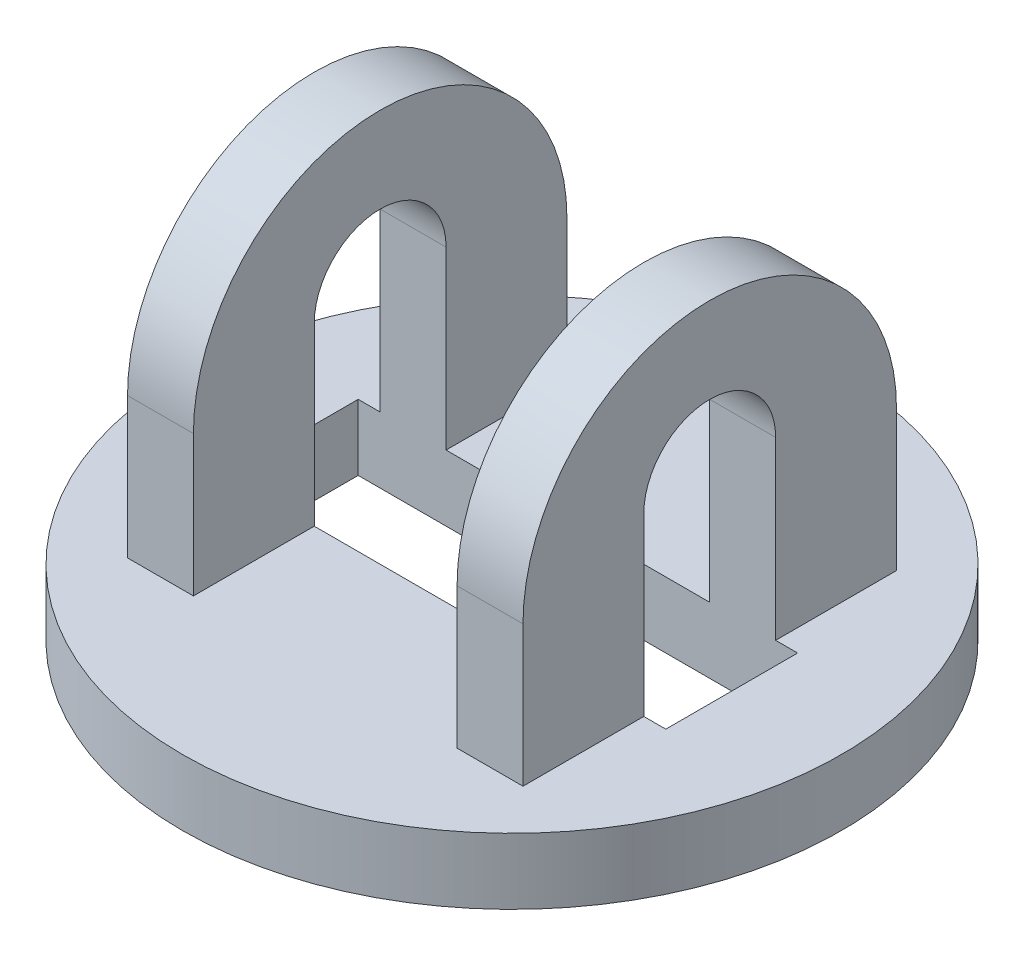
ISO-10303-21;
HEADER;
FILE_DESCRIPTION(('STEP AP214'),'2;1');
FILE_NAME('part.step','',(''),(''),'','','');
FILE_SCHEMA(('AUTOMOTIVE_DESIGN { 1 0 10303 214 1 1 1 1 }'));
ENDSEC;
DATA;
#1=APPLICATION_CONTEXT('core data for automotive mechanical design processes');
#2=APPLICATION_PROTOCOL_DEFINITION('international standard','automotive_design',2000,#1);
#3=PRODUCT_CONTEXT('',#1,'mechanical');
#4=PRODUCT('Part','Part','',(#3));
#5=PRODUCT_RELATED_PRODUCT_CATEGORY('part','',(#4));
#6=PRODUCT_DEFINITION_FORMATION('','',#4);
#7=PRODUCT_DEFINITION_CONTEXT('part definition',#1,'design');
#8=PRODUCT_DEFINITION('design','',#6,#7);
#9=PRODUCT_DEFINITION_SHAPE('','',#8);
#10=(LENGTH_UNIT() NAMED_UNIT(*) SI_UNIT(.MILLI.,.METRE.));
#11=(NAMED_UNIT(*) PLANE_ANGLE_UNIT() SI_UNIT($,.RADIAN.));
#12=(NAMED_UNIT(*) SI_UNIT($,.STERADIAN.) SOLID_ANGLE_UNIT());
#13=UNCERTAINTY_MEASURE_WITH_UNIT(LENGTH_MEASURE(1.E-05),#10,'distance_accuracy_value','');
#14=(GEOMETRIC_REPRESENTATION_CONTEXT(3) GLOBAL_UNCERTAINTY_ASSIGNED_CONTEXT((#13)) GLOBAL_UNIT_ASSIGNED_CONTEXT((#10,
#11,#12)) REPRESENTATION_CONTEXT('',''));
#15=CARTESIAN_POINT('',(0.,0.,0.));
#16=DIRECTION('',(0.,0.,1.));
#17=DIRECTION('',(1.,0.,0.));
#18=AXIS2_PLACEMENT_3D('',#15,#16,#17);
#19=CARTESIAN_POINT('',(-9.,18.,8.5));
#20=DIRECTION('',(0.,0.,-1.));
#21=DIRECTION('',(-1.,0.,0.));
#22=AXIS2_PLACEMENT_3D('',#19,#20,#21);
#23=PLANE('',#22);
#24=DIRECTION('',(-1.,0.,0.));
#25=VECTOR('',#24,1.);
#26=CARTESIAN_POINT('',(15.,9.4,8.49999999999999));
#27=LINE('',#26,#25);
#28=CARTESIAN_POINT('',(-5.99999999999998,9.4,8.5));
#29=VERTEX_POINT('',#28);
#30=CARTESIAN_POINT('',(-9.,9.4,8.5));
#31=VERTEX_POINT('',#30);
#32=EDGE_CURVE('E222',#29,#31,#27,.T.);
#33=ORIENTED_EDGE('',*,*,#32,.T.);
#34=DIRECTION('',(0.,-1.,0.));
#35=VECTOR('',#34,1.);
#36=CARTESIAN_POINT('',(-9.,18.,8.5));
#37=LINE('',#36,#35);
#38=CARTESIAN_POINT('',(-9.,3.,8.5));
#39=VERTEX_POINT('',#38);
#40=EDGE_CURVE('E275',#31,#39,#37,.T.);
#41=ORIENTED_EDGE('',*,*,#40,.T.);
#42=DIRECTION('',(1.,0.,0.));
#43=VECTOR('',#42,1.);
#44=CARTESIAN_POINT('',(-9.,3.,8.5));
#45=LINE('',#44,#43);
#46=CARTESIAN_POINT('',(-6.,3.,8.5));
#47=VERTEX_POINT('',#46);
#48=EDGE_CURVE('E270',#39,#47,#45,.T.);
#49=ORIENTED_EDGE('',*,*,#48,.T.);
#50=DIRECTION('',(0.,-1.,0.));
#51=VECTOR('',#50,1.);
#52=CARTESIAN_POINT('',(-6.,18.,8.5));
#53=LINE('',#52,#51);
#54=EDGE_CURVE('E273',#29,#47,#53,.T.);
#55=ORIENTED_EDGE('',*,*,#54,.F.);
#56=EDGE_LOOP('',(#33,#41,#49,#55));
#57=FACE_BOUND('',#56,.T.);
#58=ADVANCED_FACE('F33',(#57),#23,.F.);
#59=CARTESIAN_POINT('',(6.,18.,8.5));
#60=DIRECTION('',(0.,0.,-1.));
#61=DIRECTION('',(-1.,0.,0.));
#62=AXIS2_PLACEMENT_3D('',#59,#60,#61);
#63=PLANE('',#62);
#64=CARTESIAN_POINT('',(9.00000000000001,9.4,8.49999999999999));
#65=VERTEX_POINT('',#64);
#66=CARTESIAN_POINT('',(6.,9.4,8.5));
#67=VERTEX_POINT('',#66);
#68=EDGE_CURVE('E226',#65,#67,#27,.T.);
#69=ORIENTED_EDGE('',*,*,#68,.T.);
#70=DIRECTION('',(0.,-1.,0.));
#71=VECTOR('',#70,1.);
#72=CARTESIAN_POINT('',(6.,18.,8.5));
#73=LINE('',#72,#71);
#74=CARTESIAN_POINT('',(6.,3.,8.5));
#75=VERTEX_POINT('',#74);
#76=EDGE_CURVE('E253',#67,#75,#73,.T.);
#77=ORIENTED_EDGE('',*,*,#76,.T.);
#78=DIRECTION('',(1.,0.,0.));
#79=VECTOR('',#78,1.);
#80=CARTESIAN_POINT('',(6.,3.,8.5));
#81=LINE('',#80,#79);
#82=CARTESIAN_POINT('',(9.,3.,8.5));
#83=VERTEX_POINT('',#82);
#84=EDGE_CURVE('E248',#75,#83,#81,.T.);
#85=ORIENTED_EDGE('',*,*,#84,.T.);
#86=DIRECTION('',(0.,-1.,0.));
#87=VECTOR('',#86,1.);
#88=CARTESIAN_POINT('',(9.,18.,8.5));
#89=LINE('',#88,#87);
#90=EDGE_CURVE('E251',#65,#83,#89,.T.);
#91=ORIENTED_EDGE('',*,*,#90,.F.);
#92=EDGE_LOOP('',(#69,#77,#85,#91));
#93=FACE_BOUND('',#92,.T.);
#94=ADVANCED_FACE('F352',(#93),#63,.F.);
#95=CARTESIAN_POINT('',(0.,3.,0.));
#96=DIRECTION('',(0.,1.,0.));
#97=DIRECTION('',(0.,0.,1.));
#98=AXIS2_PLACEMENT_3D('',#95,#96,#97);
#99=PLANE('',#98);
#100=DIRECTION('',(1.,0.,0.));
#101=VECTOR('',#100,1.);
#102=CARTESIAN_POINT('',(0.,3.,3.));
#103=LINE('',#102,#101);
#104=CARTESIAN_POINT('',(-6.,3.,3.));
#105=VERTEX_POINT('',#104);
#106=CARTESIAN_POINT('',(6.,3.,3.));
#107=VERTEX_POINT('',#106);
#108=EDGE_CURVE('E199',#105,#107,#103,.T.);
#109=ORIENTED_EDGE('',*,*,#108,.F.);
#110=DIRECTION('',(0.,0.,-1.));
#111=VECTOR('',#110,1.);
#112=CARTESIAN_POINT('',(-6.,3.,-8.5));
#113=LINE('',#112,#111);
#114=EDGE_CURVE('E262',#47,#105,#113,.T.);
#115=ORIENTED_EDGE('',*,*,#114,.F.);
#116=ORIENTED_EDGE('',*,*,#48,.F.);
#117=DIRECTION('',(0.,0.,1.));
#118=VECTOR('',#117,1.);
#119=CARTESIAN_POINT('',(-9.00000000000001,3.,-8.5));
#120=LINE('',#119,#118);
#121=CARTESIAN_POINT('',(-9.,3.,3.));
#122=VERTEX_POINT('',#121);
#123=EDGE_CURVE('E268',#122,#39,#120,.T.);
#124=ORIENTED_EDGE('',*,*,#123,.F.);
#125=CARTESIAN_POINT('',(-10.,3.,3.));
#126=VERTEX_POINT('',#125);
#127=EDGE_CURVE('E208',#126,#122,#103,.T.);
#128=ORIENTED_EDGE('',*,*,#127,.F.);
#129=DIRECTION('',(0.,0.,1.));
#130=VECTOR('',#129,1.);
#131=CARTESIAN_POINT('',(-10.,3.,0.));
#132=LINE('',#131,#130);
#133=CARTESIAN_POINT('',(-10.,3.,-3.));
#134=VERTEX_POINT('',#133);
#135=EDGE_CURVE('E219',#134,#126,#132,.T.);
#136=ORIENTED_EDGE('',*,*,#135,.F.);
#137=DIRECTION('',(-1.,0.,0.));
#138=VECTOR('',#137,1.);
#139=CARTESIAN_POINT('',(0.,3.,-3.));
#140=LINE('',#139,#138);
#141=CARTESIAN_POINT('',(-9.,3.,-3.));
#142=VERTEX_POINT('',#141);
#143=EDGE_CURVE('E196',#142,#134,#140,.T.);
#144=ORIENTED_EDGE('',*,*,#143,.F.);
#145=CARTESIAN_POINT('',(-9.00000000000001,3.,-8.5));
#146=VERTEX_POINT('',#145);
#147=EDGE_CURVE('E195',#146,#142,#120,.T.);
#148=ORIENTED_EDGE('',*,*,#147,.F.);
#149=DIRECTION('',(-1.,0.,0.));
#150=VECTOR('',#149,1.);
#151=CARTESIAN_POINT('',(-9.00000000000001,3.,-8.5));
#152=LINE('',#151,#150);
#153=CARTESIAN_POINT('',(-6.,3.,-8.5));
#154=VERTEX_POINT('',#153);
#155=EDGE_CURVE('E265',#154,#146,#152,.T.);
#156=ORIENTED_EDGE('',*,*,#155,.F.);
#157=CARTESIAN_POINT('',(-6.,3.,-3.));
#158=VERTEX_POINT('',#157);
#159=EDGE_CURVE('E261',#158,#154,#113,.T.);
#160=ORIENTED_EDGE('',*,*,#159,.F.);
#161=CARTESIAN_POINT('',(6.,3.,-3.));
#162=VERTEX_POINT('',#161);
#163=EDGE_CURVE('E201',#162,#158,#140,.T.);
#164=ORIENTED_EDGE('',*,*,#163,.F.);
#165=DIRECTION('',(0.,0.,1.));
#166=VECTOR('',#165,1.);
#167=CARTESIAN_POINT('',(6.,3.,-8.5));
#168=LINE('',#167,#166);
#169=CARTESIAN_POINT('',(6.,3.,-8.5));
#170=VERTEX_POINT('',#169);
#171=EDGE_CURVE('E245',#170,#162,#168,.T.);
#172=ORIENTED_EDGE('',*,*,#171,.F.);
#173=DIRECTION('',(-1.,0.,0.));
#174=VECTOR('',#173,1.);
#175=CARTESIAN_POINT('',(6.,3.,-8.5));
#176=LINE('',#175,#174);
#177=CARTESIAN_POINT('',(8.99999999999999,3.,-8.5));
#178=VERTEX_POINT('',#177);
#179=EDGE_CURVE('E241',#178,#170,#176,.T.);
#180=ORIENTED_EDGE('',*,*,#179,.F.);
#181=DIRECTION('',(0.,0.,-1.));
#182=VECTOR('',#181,1.);
#183=CARTESIAN_POINT('',(8.99999999999999,3.,-8.5));
#184=LINE('',#183,#182);
#185=CARTESIAN_POINT('',(9.,3.,-3.));
#186=VERTEX_POINT('',#185);
#187=EDGE_CURVE('E237',#186,#178,#184,.T.);
#188=ORIENTED_EDGE('',*,*,#187,.F.);
#189=CARTESIAN_POINT('',(10.,3.,-3.));
#190=VERTEX_POINT('',#189);
#191=EDGE_CURVE('E197',#190,#186,#140,.T.);
#192=ORIENTED_EDGE('',*,*,#191,.F.);
#193=DIRECTION('',(0.,0.,-1.));
#194=VECTOR('',#193,1.);
#195=CARTESIAN_POINT('',(10.,3.,0.));
#196=LINE('',#195,#194);
#197=CARTESIAN_POINT('',(10.,3.,3.));
#198=VERTEX_POINT('',#197);
#199=EDGE_CURVE('E217',#198,#190,#196,.T.);
#200=ORIENTED_EDGE('',*,*,#199,.F.);
#201=CARTESIAN_POINT('',(9.,3.,3.));
#202=VERTEX_POINT('',#201);
#203=EDGE_CURVE('E209',#202,#198,#103,.T.);
#204=ORIENTED_EDGE('',*,*,#203,.F.);
#205=EDGE_CURVE('E238',#83,#202,#184,.T.);
#206=ORIENTED_EDGE('',*,*,#205,.F.);
#207=ORIENTED_EDGE('',*,*,#84,.F.);
#208=EDGE_CURVE('E244',#107,#75,#168,.T.);
#209=ORIENTED_EDGE('',*,*,#208,.F.);
#210=EDGE_LOOP('',(#109,#115,#116,#124,#128,#136,#144,#148,#156,#160,#164,#172,#180,#188,#192,
#200,#204,#206,#207,#209));
#211=FACE_BOUND('',#210,.T.);
#212=CARTESIAN_POINT('',(0.,3.,0.));
#213=DIRECTION('',(0.,1.,0.));
#214=DIRECTION('',(0.,0.,1.));
#215=AXIS2_PLACEMENT_3D('',#212,#213,#214);
#216=CIRCLE('',#215,15.);
#217=CARTESIAN_POINT('',(0.,3.,15.));
#218=VERTEX_POINT('',#217);
#219=EDGE_CURVE('E284',#218,#218,#216,.T.);
#220=ORIENTED_EDGE('',*,*,#219,.T.);
#221=EDGE_LOOP('',(#220));
#222=FACE_BOUND('',#221,.T.);
#223=ADVANCED_FACE('F300',(#211,#222),#99,.T.);
#224=CARTESIAN_POINT('',(0.,3.,0.));
#225=DIRECTION('',(0.,-1.,0.));
#226=DIRECTION('',(0.,0.,-1.));
#227=AXIS2_PLACEMENT_3D('',#224,#225,#226);
#228=CYLINDRICAL_SURFACE('',#227,15.);
#229=ORIENTED_EDGE('',*,*,#219,.F.);
#230=EDGE_LOOP('',(#229));
#231=FACE_BOUND('',#230,.T.);
#232=CARTESIAN_POINT('',(0.,0.,0.));
#233=DIRECTION('',(0.,1.,0.));
#234=DIRECTION('',(0.,0.,1.));
#235=AXIS2_PLACEMENT_3D('',#232,#233,#234);
#236=CIRCLE('',#235,15.);
#237=CARTESIAN_POINT('',(0.,0.,15.));
#238=VERTEX_POINT('',#237);
#239=EDGE_CURVE('E283',#238,#238,#236,.T.);
#240=ORIENTED_EDGE('',*,*,#239,.T.);
#241=EDGE_LOOP('',(#240));
#242=FACE_BOUND('',#241,.T.);
#243=ADVANCED_FACE('F35',(#231,#242),#228,.T.);
#244=CARTESIAN_POINT('',(0.,0.,0.));
#245=DIRECTION('',(0.,1.,0.));
#246=DIRECTION('',(0.,0.,1.));
#247=AXIS2_PLACEMENT_3D('',#244,#245,#246);
#248=PLANE('',#247);
#249=DIRECTION('',(1.,0.,0.));
#250=VECTOR('',#249,1.);
#251=CARTESIAN_POINT('',(10.,0.,-3.));
#252=LINE('',#251,#250);
#253=CARTESIAN_POINT('',(-10.,0.,-3.));
#254=VERTEX_POINT('',#253);
#255=CARTESIAN_POINT('',(10.,0.,-3.));
#256=VERTEX_POINT('',#255);
#257=EDGE_CURVE('E320',#254,#256,#252,.T.);
#258=ORIENTED_EDGE('',*,*,#257,.F.);
#259=DIRECTION('',(0.,0.,-1.));
#260=VECTOR('',#259,1.);
#261=CARTESIAN_POINT('',(-10.,0.,3.));
#262=LINE('',#261,#260);
#263=CARTESIAN_POINT('',(-10.,0.,3.));
#264=VERTEX_POINT('',#263);
#265=EDGE_CURVE('E48',#264,#254,#262,.T.);
#266=ORIENTED_EDGE('',*,*,#265,.F.);
#267=DIRECTION('',(-1.,0.,0.));
#268=VECTOR('',#267,1.);
#269=CARTESIAN_POINT('',(10.,0.,3.));
#270=LINE('',#269,#268);
#271=CARTESIAN_POINT('',(10.,0.,3.));
#272=VERTEX_POINT('',#271);
#273=EDGE_CURVE('E314',#272,#264,#270,.T.);
#274=ORIENTED_EDGE('',*,*,#273,.F.);
#275=DIRECTION('',(0.,0.,1.));
#276=VECTOR('',#275,1.);
#277=CARTESIAN_POINT('',(10.,0.,3.));
#278=LINE('',#277,#276);
#279=EDGE_CURVE('E317',#256,#272,#278,.T.);
#280=ORIENTED_EDGE('',*,*,#279,.F.);
#281=EDGE_LOOP('',(#258,#266,#274,#280));
#282=FACE_BOUND('',#281,.T.);
#283=ORIENTED_EDGE('',*,*,#239,.F.);
#284=EDGE_LOOP('',(#283));
#285=FACE_BOUND('',#284,.T.);
#286=ADVANCED_FACE('F377',(#282,#285),#248,.F.);
#287=CARTESIAN_POINT('',(-6.,18.,-8.5));
#288=DIRECTION('',(-1.,0.,0.));
#289=DIRECTION('',(0.,0.,1.));
#290=AXIS2_PLACEMENT_3D('',#287,#288,#289);
#291=PLANE('',#290);
#292=DIRECTION('',(0.,1.,0.));
#293=VECTOR('',#292,1.);
#294=CARTESIAN_POINT('',(-6.,18.,3.));
#295=LINE('',#294,#293);
#296=CARTESIAN_POINT('',(-6.,11.,3.));
#297=VERTEX_POINT('',#296);
#298=EDGE_CURVE('E207',#105,#297,#295,.T.);
#299=ORIENTED_EDGE('',*,*,#298,.T.);
#300=CARTESIAN_POINT('',(-6.,11.,0.));
#301=DIRECTION('',(-1.,0.,0.));
#302=DIRECTION('',(0.,0.,1.));
#303=AXIS2_PLACEMENT_3D('',#300,#301,#302);
#304=CIRCLE('',#303,3.);
#305=CARTESIAN_POINT('',(-6.,11.,-3.));
#306=VERTEX_POINT('',#305);
#307=EDGE_CURVE('E324',#297,#306,#304,.T.);
#308=ORIENTED_EDGE('',*,*,#307,.T.);
#309=DIRECTION('',(0.,-1.,0.));
#310=VECTOR('',#309,1.);
#311=CARTESIAN_POINT('',(-6.,18.,-3.));
#312=LINE('',#311,#310);
#313=EDGE_CURVE('E189',#306,#158,#312,.T.);
#314=ORIENTED_EDGE('',*,*,#313,.T.);
#315=ORIENTED_EDGE('',*,*,#159,.T.);
#316=DIRECTION('',(0.,-1.,0.));
#317=VECTOR('',#316,1.);
#318=CARTESIAN_POINT('',(-6.,18.,-8.5));
#319=LINE('',#318,#317);
#320=CARTESIAN_POINT('',(-5.99999999999999,9.4,-8.5));
#321=VERTEX_POINT('',#320);
#322=EDGE_CURVE('E280',#321,#154,#319,.T.);
#323=ORIENTED_EDGE('',*,*,#322,.F.);
#324=CARTESIAN_POINT('',(-6.,9.4,0.));
#325=DIRECTION('',(-1.,0.,0.));
#326=DIRECTION('',(0.,0.,1.));
#327=AXIS2_PLACEMENT_3D('',#324,#325,#326);
#328=CIRCLE('',#327,8.5);
#329=EDGE_CURVE('E234',#321,#29,#328,.F.);
#330=ORIENTED_EDGE('',*,*,#329,.T.);
#331=ORIENTED_EDGE('',*,*,#54,.T.);
#332=ORIENTED_EDGE('',*,*,#114,.T.);
#333=EDGE_LOOP('',(#299,#308,#314,#315,#323,#330,#331,#332));
#334=FACE_BOUND('',#333,.T.);
#335=ADVANCED_FACE('F406',(#334),#291,.F.);
#336=CARTESIAN_POINT('',(-9.00000000000001,18.,-8.5));
#337=DIRECTION('',(0.,0.,1.));
#338=DIRECTION('',(1.,0.,0.));
#339=AXIS2_PLACEMENT_3D('',#336,#337,#338);
#340=PLANE('',#339);
#341=DIRECTION('',(0.,-1.,0.));
#342=VECTOR('',#341,1.);
#343=CARTESIAN_POINT('',(-9.00000000000001,18.,-8.5));
#344=LINE('',#343,#342);
#345=CARTESIAN_POINT('',(-9.00000000000001,9.4,-8.5));
#346=VERTEX_POINT('',#345);
#347=EDGE_CURVE('E278',#346,#146,#344,.T.);
#348=ORIENTED_EDGE('',*,*,#347,.F.);
#349=DIRECTION('',(-1.,0.,0.));
#350=VECTOR('',#349,1.);
#351=CARTESIAN_POINT('',(15.,9.4,-8.50000000000001));
#352=LINE('',#351,#350);
#353=EDGE_CURVE('E223',#321,#346,#352,.T.);
#354=ORIENTED_EDGE('',*,*,#353,.F.);
#355=ORIENTED_EDGE('',*,*,#322,.T.);
#356=ORIENTED_EDGE('',*,*,#155,.T.);
#357=EDGE_LOOP('',(#348,#354,#355,#356));
#358=FACE_BOUND('',#357,.T.);
#359=ADVANCED_FACE('F370',(#358),#340,.F.);
#360=CARTESIAN_POINT('',(-9.00000000000001,18.,-8.5));
#361=DIRECTION('',(1.,0.,0.));
#362=DIRECTION('',(0.,0.,-1.));
#363=AXIS2_PLACEMENT_3D('',#360,#361,#362);
#364=PLANE('',#363);
#365=DIRECTION('',(0.,1.,0.));
#366=VECTOR('',#365,1.);
#367=CARTESIAN_POINT('',(-9.,18.,-3.));
#368=LINE('',#367,#366);
#369=CARTESIAN_POINT('',(-9.,11.,-3.));
#370=VERTEX_POINT('',#369);
#371=EDGE_CURVE('E186',#142,#370,#368,.T.);
#372=ORIENTED_EDGE('',*,*,#371,.T.);
#373=CARTESIAN_POINT('',(-9.,11.,0.));
#374=DIRECTION('',(-1.,0.,0.));
#375=DIRECTION('',(0.,0.,1.));
#376=AXIS2_PLACEMENT_3D('',#373,#374,#375);
#377=CIRCLE('',#376,3.);
#378=CARTESIAN_POINT('',(-9.,11.,3.));
#379=VERTEX_POINT('',#378);
#380=EDGE_CURVE('E170',#379,#370,#377,.T.);
#381=ORIENTED_EDGE('',*,*,#380,.F.);
#382=DIRECTION('',(0.,-1.,0.));
#383=VECTOR('',#382,1.);
#384=CARTESIAN_POINT('',(-9.,18.,3.));
#385=LINE('',#384,#383);
#386=EDGE_CURVE('E215',#379,#122,#385,.T.);
#387=ORIENTED_EDGE('',*,*,#386,.T.);
#388=ORIENTED_EDGE('',*,*,#123,.T.);
#389=ORIENTED_EDGE('',*,*,#40,.F.);
#390=CARTESIAN_POINT('',(-9.,9.4,0.));
#391=DIRECTION('',(1.,0.,0.));
#392=DIRECTION('',(0.,0.,-1.));
#393=AXIS2_PLACEMENT_3D('',#390,#391,#392);
#394=CIRCLE('',#393,8.5);
#395=EDGE_CURVE('E56',#346,#31,#394,.T.);
#396=ORIENTED_EDGE('',*,*,#395,.F.);
#397=ORIENTED_EDGE('',*,*,#347,.T.);
#398=ORIENTED_EDGE('',*,*,#147,.T.);
#399=EDGE_LOOP('',(#372,#381,#387,#388,#389,#396,#397,#398));
#400=FACE_BOUND('',#399,.T.);
#401=ADVANCED_FACE('F193',(#400),#364,.F.);
#402=CARTESIAN_POINT('',(8.99999999999999,18.,-8.5));
#403=DIRECTION('',(-1.,0.,0.));
#404=DIRECTION('',(0.,0.,1.));
#405=AXIS2_PLACEMENT_3D('',#402,#403,#404);
#406=PLANE('',#405);
#407=DIRECTION('',(0.,1.,0.));
#408=VECTOR('',#407,1.);
#409=CARTESIAN_POINT('',(9.,18.,3.));
#410=LINE('',#409,#408);
#411=CARTESIAN_POINT('',(9.,11.,3.));
#412=VERTEX_POINT('',#411);
#413=EDGE_CURVE('E212',#202,#412,#410,.T.);
#414=ORIENTED_EDGE('',*,*,#413,.T.);
#415=CARTESIAN_POINT('',(9.,11.,0.));
#416=DIRECTION('',(-1.,0.,0.));
#417=DIRECTION('',(0.,0.,1.));
#418=AXIS2_PLACEMENT_3D('',#415,#416,#417);
#419=CIRCLE('',#418,3.);
#420=CARTESIAN_POINT('',(9.,11.,-3.00000000000001));
#421=VERTEX_POINT('',#420);
#422=EDGE_CURVE('E327',#412,#421,#419,.T.);
#423=ORIENTED_EDGE('',*,*,#422,.T.);
#424=DIRECTION('',(0.,-1.,0.));
#425=VECTOR('',#424,1.);
#426=CARTESIAN_POINT('',(9.,18.,-3.));
#427=LINE('',#426,#425);
#428=EDGE_CURVE('E202',#421,#186,#427,.T.);
#429=ORIENTED_EDGE('',*,*,#428,.T.);
#430=ORIENTED_EDGE('',*,*,#187,.T.);
#431=DIRECTION('',(0.,-1.,0.));
#432=VECTOR('',#431,1.);
#433=CARTESIAN_POINT('',(8.99999999999999,18.,-8.5));
#434=LINE('',#433,#432);
#435=CARTESIAN_POINT('',(9.,9.4,-8.50000000000001));
#436=VERTEX_POINT('',#435);
#437=EDGE_CURVE('E258',#436,#178,#434,.T.);
#438=ORIENTED_EDGE('',*,*,#437,.F.);
#439=CARTESIAN_POINT('',(9.,9.4,0.));
#440=DIRECTION('',(-1.,0.,0.));
#441=DIRECTION('',(0.,0.,1.));
#442=AXIS2_PLACEMENT_3D('',#439,#440,#441);
#443=CIRCLE('',#442,8.5);
#444=EDGE_CURVE('E231',#436,#65,#443,.F.);
#445=ORIENTED_EDGE('',*,*,#444,.T.);
#446=ORIENTED_EDGE('',*,*,#90,.T.);
#447=ORIENTED_EDGE('',*,*,#205,.T.);
#448=EDGE_LOOP('',(#414,#423,#429,#430,#438,#445,#446,#447));
#449=FACE_BOUND('',#448,.T.);
#450=ADVANCED_FACE('F332',(#449),#406,.F.);
#451=CARTESIAN_POINT('',(6.,18.,-8.5));
#452=DIRECTION('',(0.,0.,1.));
#453=DIRECTION('',(1.,0.,0.));
#454=AXIS2_PLACEMENT_3D('',#451,#452,#453);
#455=PLANE('',#454);
#456=DIRECTION('',(0.,-1.,0.));
#457=VECTOR('',#456,1.);
#458=CARTESIAN_POINT('',(6.,18.,-8.5));
#459=LINE('',#458,#457);
#460=CARTESIAN_POINT('',(6.,9.4,-8.50000000000001));
#461=VERTEX_POINT('',#460);
#462=EDGE_CURVE('E256',#461,#170,#459,.T.);
#463=ORIENTED_EDGE('',*,*,#462,.F.);
#464=EDGE_CURVE('E225',#436,#461,#352,.T.);
#465=ORIENTED_EDGE('',*,*,#464,.F.);
#466=ORIENTED_EDGE('',*,*,#437,.T.);
#467=ORIENTED_EDGE('',*,*,#179,.T.);
#468=EDGE_LOOP('',(#463,#465,#466,#467));
#469=FACE_BOUND('',#468,.T.);
#470=ADVANCED_FACE('F344',(#469),#455,.F.);
#471=CARTESIAN_POINT('',(6.,18.,-8.5));
#472=DIRECTION('',(1.,0.,0.));
#473=DIRECTION('',(0.,0.,-1.));
#474=AXIS2_PLACEMENT_3D('',#471,#472,#473);
#475=PLANE('',#474);
#476=DIRECTION('',(0.,1.,0.));
#477=VECTOR('',#476,1.);
#478=CARTESIAN_POINT('',(6.,18.,-3.));
#479=LINE('',#478,#477);
#480=CARTESIAN_POINT('',(6.,11.,-3.00000000000001));
#481=VERTEX_POINT('',#480);
#482=EDGE_CURVE('E41',#162,#481,#479,.T.);
#483=ORIENTED_EDGE('',*,*,#482,.T.);
#484=CARTESIAN_POINT('',(6.,11.,0.));
#485=DIRECTION('',(1.,0.,0.));
#486=DIRECTION('',(0.,0.,-1.));
#487=AXIS2_PLACEMENT_3D('',#484,#485,#486);
#488=CIRCLE('',#487,3.);
#489=CARTESIAN_POINT('',(6.,11.,2.99999999999999));
#490=VERTEX_POINT('',#489);
#491=EDGE_CURVE('E181',#481,#490,#488,.T.);
#492=ORIENTED_EDGE('',*,*,#491,.T.);
#493=DIRECTION('',(0.,-1.,0.));
#494=VECTOR('',#493,1.);
#495=CARTESIAN_POINT('',(6.,18.,3.));
#496=LINE('',#495,#494);
#497=EDGE_CURVE('E11',#490,#107,#496,.T.);
#498=ORIENTED_EDGE('',*,*,#497,.T.);
#499=ORIENTED_EDGE('',*,*,#208,.T.);
#500=ORIENTED_EDGE('',*,*,#76,.F.);
#501=CARTESIAN_POINT('',(6.,9.4,0.));
#502=DIRECTION('',(1.,0.,0.));
#503=DIRECTION('',(0.,0.,-1.));
#504=AXIS2_PLACEMENT_3D('',#501,#502,#503);
#505=CIRCLE('',#504,8.5);
#506=EDGE_CURVE('E228',#67,#461,#505,.F.);
#507=ORIENTED_EDGE('',*,*,#506,.T.);
#508=ORIENTED_EDGE('',*,*,#462,.T.);
#509=ORIENTED_EDGE('',*,*,#171,.T.);
#510=EDGE_LOOP('',(#483,#492,#498,#499,#500,#507,#508,#509));
#511=FACE_BOUND('',#510,.T.);
#512=ADVANCED_FACE('F291',(#511),#475,.F.);
#513=CARTESIAN_POINT('',(15.,9.4,0.));
#514=DIRECTION('',(-1.,0.,0.));
#515=DIRECTION('',(0.,0.,1.));
#516=AXIS2_PLACEMENT_3D('',#513,#514,#515);
#517=CYLINDRICAL_SURFACE('',#516,8.5);
#518=ORIENTED_EDGE('',*,*,#464,.T.);
#519=ORIENTED_EDGE('',*,*,#506,.F.);
#520=ORIENTED_EDGE('',*,*,#68,.F.);
#521=ORIENTED_EDGE('',*,*,#444,.F.);
#522=EDGE_LOOP('',(#518,#519,#520,#521));
#523=FACE_BOUND('',#522,.T.);
#524=ADVANCED_FACE('F346',(#523),#517,.T.);
#525=ORIENTED_EDGE('',*,*,#353,.T.);
#526=ORIENTED_EDGE('',*,*,#395,.T.);
#527=ORIENTED_EDGE('',*,*,#32,.F.);
#528=ORIENTED_EDGE('',*,*,#329,.F.);
#529=EDGE_LOOP('',(#525,#526,#527,#528));
#530=FACE_BOUND('',#529,.T.);
#531=ADVANCED_FACE('F435',(#530),#517,.T.);
#532=CARTESIAN_POINT('',(10.,11.,3.));
#533=DIRECTION('',(0.,0.,1.));
#534=DIRECTION('',(1.,0.,0.));
#535=AXIS2_PLACEMENT_3D('',#532,#533,#534);
#536=PLANE('',#535);
#537=ORIENTED_EDGE('',*,*,#127,.T.);
#538=ORIENTED_EDGE('',*,*,#386,.F.);
#539=DIRECTION('',(-1.,0.,0.));
#540=VECTOR('',#539,1.);
#541=CARTESIAN_POINT('',(10.,11.,3.));
#542=LINE('',#541,#540);
#543=EDGE_CURVE('E176',#297,#379,#542,.T.);
#544=ORIENTED_EDGE('',*,*,#543,.F.);
#545=ORIENTED_EDGE('',*,*,#298,.F.);
#546=ORIENTED_EDGE('',*,*,#108,.T.);
#547=ORIENTED_EDGE('',*,*,#497,.F.);
#548=EDGE_CURVE('E311',#412,#490,#542,.T.);
#549=ORIENTED_EDGE('',*,*,#548,.F.);
#550=ORIENTED_EDGE('',*,*,#413,.F.);
#551=ORIENTED_EDGE('',*,*,#203,.T.);
#552=DIRECTION('',(0.,-1.,0.));
#553=VECTOR('',#552,1.);
#554=CARTESIAN_POINT('',(10.,11.,3.));
#555=LINE('',#554,#553);
#556=EDGE_CURVE('E305',#198,#272,#555,.T.);
#557=ORIENTED_EDGE('',*,*,#556,.T.);
#558=ORIENTED_EDGE('',*,*,#273,.T.);
#559=DIRECTION('',(0.,-1.,0.));
#560=VECTOR('',#559,1.);
#561=CARTESIAN_POINT('',(-10.,11.,3.));
#562=LINE('',#561,#560);
#563=EDGE_CURVE('E304',#126,#264,#562,.T.);
#564=ORIENTED_EDGE('',*,*,#563,.F.);
#565=EDGE_LOOP('',(#537,#538,#544,#545,#546,#547,#549,#550,#551,#557,#558,#564));
#566=FACE_BOUND('',#565,.T.);
#567=ADVANCED_FACE('F359',(#566),#536,.F.);
#568=CARTESIAN_POINT('',(10.,11.,-3.));
#569=DIRECTION('',(0.,0.,-1.));
#570=DIRECTION('',(-1.,0.,0.));
#571=AXIS2_PLACEMENT_3D('',#568,#569,#570);
#572=PLANE('',#571);
#573=ORIENTED_EDGE('',*,*,#143,.T.);
#574=DIRECTION('',(0.,-1.,0.));
#575=VECTOR('',#574,1.);
#576=CARTESIAN_POINT('',(-10.,11.,-3.));
#577=LINE('',#576,#575);
#578=EDGE_CURVE('E308',#134,#254,#577,.T.);
#579=ORIENTED_EDGE('',*,*,#578,.T.);
#580=ORIENTED_EDGE('',*,*,#257,.T.);
#581=DIRECTION('',(0.,-1.,0.));
#582=VECTOR('',#581,1.);
#583=CARTESIAN_POINT('',(10.,11.,-3.));
#584=LINE('',#583,#582);
#585=EDGE_CURVE('E310',#190,#256,#584,.T.);
#586=ORIENTED_EDGE('',*,*,#585,.F.);
#587=ORIENTED_EDGE('',*,*,#191,.T.);
#588=ORIENTED_EDGE('',*,*,#428,.F.);
#589=DIRECTION('',(1.,0.,0.));
#590=VECTOR('',#589,1.);
#591=CARTESIAN_POINT('',(10.,11.,-3.));
#592=LINE('',#591,#590);
#593=EDGE_CURVE('E190',#481,#421,#592,.T.);
#594=ORIENTED_EDGE('',*,*,#593,.F.);
#595=ORIENTED_EDGE('',*,*,#482,.F.);
#596=ORIENTED_EDGE('',*,*,#163,.T.);
#597=ORIENTED_EDGE('',*,*,#313,.F.);
#598=EDGE_CURVE('E173',#370,#306,#592,.T.);
#599=ORIENTED_EDGE('',*,*,#598,.F.);
#600=ORIENTED_EDGE('',*,*,#371,.F.);
#601=EDGE_LOOP('',(#573,#579,#580,#586,#587,#588,#594,#595,#596,#597,#599,#600));
#602=FACE_BOUND('',#601,.T.);
#603=ADVANCED_FACE('F185',(#602),#572,.F.);
#604=CARTESIAN_POINT('',(-10.,11.,3.));
#605=DIRECTION('',(-1.,0.,0.));
#606=DIRECTION('',(0.,0.,1.));
#607=AXIS2_PLACEMENT_3D('',#604,#605,#606);
#608=PLANE('',#607);
#609=ORIENTED_EDGE('',*,*,#135,.T.);
#610=ORIENTED_EDGE('',*,*,#563,.T.);
#611=ORIENTED_EDGE('',*,*,#265,.T.);
#612=ORIENTED_EDGE('',*,*,#578,.F.);
#613=EDGE_LOOP('',(#609,#610,#611,#612));
#614=FACE_BOUND('',#613,.T.);
#615=ADVANCED_FACE('F373',(#614),#608,.F.);
#616=CARTESIAN_POINT('',(10.,11.,3.));
#617=DIRECTION('',(1.,0.,0.));
#618=DIRECTION('',(0.,0.,-1.));
#619=AXIS2_PLACEMENT_3D('',#616,#617,#618);
#620=PLANE('',#619);
#621=ORIENTED_EDGE('',*,*,#199,.T.);
#622=ORIENTED_EDGE('',*,*,#585,.T.);
#623=ORIENTED_EDGE('',*,*,#279,.T.);
#624=ORIENTED_EDGE('',*,*,#556,.F.);
#625=EDGE_LOOP('',(#621,#622,#623,#624));
#626=FACE_BOUND('',#625,.T.);
#627=ADVANCED_FACE('F380',(#626),#620,.F.);
#628=CARTESIAN_POINT('',(15.,11.,0.));
#629=DIRECTION('',(-1.,0.,0.));
#630=DIRECTION('',(0.,0.,1.));
#631=AXIS2_PLACEMENT_3D('',#628,#629,#630);
#632=CYLINDRICAL_SURFACE('',#631,3.);
#633=ORIENTED_EDGE('',*,*,#548,.T.);
#634=ORIENTED_EDGE('',*,*,#491,.F.);
#635=ORIENTED_EDGE('',*,*,#593,.T.);
#636=ORIENTED_EDGE('',*,*,#422,.F.);
#637=EDGE_LOOP('',(#633,#634,#635,#636));
#638=FACE_BOUND('',#637,.T.);
#639=ADVANCED_FACE('F382',(#638),#632,.F.);
#640=ORIENTED_EDGE('',*,*,#543,.T.);
#641=ORIENTED_EDGE('',*,*,#380,.T.);
#642=ORIENTED_EDGE('',*,*,#598,.T.);
#643=ORIENTED_EDGE('',*,*,#307,.F.);
#644=EDGE_LOOP('',(#640,#641,#642,#643));
#645=FACE_BOUND('',#644,.T.);
#646=ADVANCED_FACE('F172',(#645),#632,.F.);
#647=CLOSED_SHELL('',(#58,#94,#223,#243,#286,#335,#359,#401,#450,#470,#512,#524,#531,#567,#603,
#615,#627,#639,#646));
#648=MANIFOLD_SOLID_BREP('B2',#647);
#649=ADVANCED_BREP_SHAPE_REPRESENTATION('',(#18,#648),#14);
#650=SHAPE_DEFINITION_REPRESENTATION(#9,#649);
ENDSEC;
END-ISO-10303-21;
